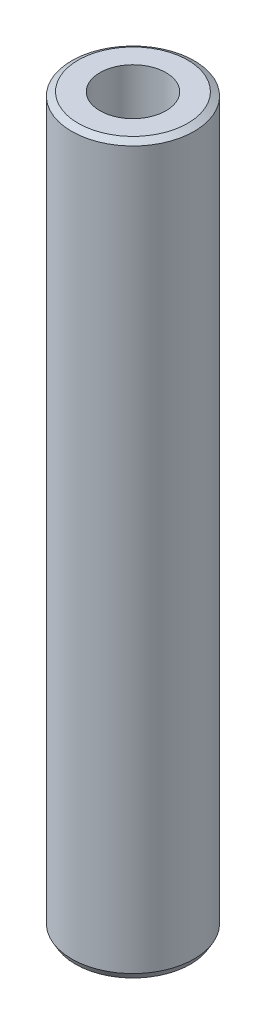
ISO-10303-21;
HEADER;
FILE_DESCRIPTION(('STEP AP214'),'2;1');
FILE_NAME('part.step','',(''),(''),'','','');
FILE_SCHEMA(('AUTOMOTIVE_DESIGN { 1 0 10303 214 1 1 1 1 }'));
ENDSEC;
DATA;
#1=APPLICATION_CONTEXT('core data for automotive mechanical design processes');
#2=APPLICATION_PROTOCOL_DEFINITION('international standard','automotive_design',2000,#1);
#3=PRODUCT_CONTEXT('',#1,'mechanical');
#4=PRODUCT('Part','Part','',(#3));
#5=PRODUCT_RELATED_PRODUCT_CATEGORY('part','',(#4));
#6=PRODUCT_DEFINITION_FORMATION('','',#4);
#7=PRODUCT_DEFINITION_CONTEXT('part definition',#1,'design');
#8=PRODUCT_DEFINITION('design','',#6,#7);
#9=PRODUCT_DEFINITION_SHAPE('','',#8);
#10=(LENGTH_UNIT() NAMED_UNIT(*) SI_UNIT(.MILLI.,.METRE.));
#11=(NAMED_UNIT(*) PLANE_ANGLE_UNIT() SI_UNIT($,.RADIAN.));
#12=(NAMED_UNIT(*) SI_UNIT($,.STERADIAN.) SOLID_ANGLE_UNIT());
#13=UNCERTAINTY_MEASURE_WITH_UNIT(LENGTH_MEASURE(1.E-05),#10,'distance_accuracy_value','');
#14=(GEOMETRIC_REPRESENTATION_CONTEXT(3) GLOBAL_UNCERTAINTY_ASSIGNED_CONTEXT((#13)) GLOBAL_UNIT_ASSIGNED_CONTEXT((#10,
#11,#12)) REPRESENTATION_CONTEXT('',''));
#15=CARTESIAN_POINT('',(0.,0.,0.));
#16=DIRECTION('',(0.,0.,1.));
#17=DIRECTION('',(1.,0.,0.));
#18=AXIS2_PLACEMENT_3D('',#15,#16,#17);
#19=CARTESIAN_POINT('',(0.,59.3318698835942,0.));
#20=DIRECTION('',(0.,-1.,0.));
#21=DIRECTION('',(0.,0.,-1.));
#22=AXIS2_PLACEMENT_3D('',#19,#20,#21);
#23=CYLINDRICAL_SURFACE('',#22,5.);
#24=CARTESIAN_POINT('',(0.,59.0266979990249,0.));
#25=DIRECTION('',(0.,1.,0.));
#26=DIRECTION('',(0.,0.,1.));
#27=AXIS2_PLACEMENT_3D('',#24,#25,#26);
#28=CIRCLE('',#27,5.);
#29=CARTESIAN_POINT('',(0.,59.0266979990249,5.));
#30=VERTEX_POINT('',#29);
#31=EDGE_CURVE('E50',#30,#30,#28,.F.);
#32=ORIENTED_EDGE('',*,*,#31,.T.);
#33=EDGE_LOOP('',(#32));
#34=FACE_BOUND('',#33,.T.);
#35=CARTESIAN_POINT('',(0.,0.528573209115569,0.));
#36=DIRECTION('',(0.,1.,0.));
#37=DIRECTION('',(0.,0.,1.));
#38=AXIS2_PLACEMENT_3D('',#35,#36,#37);
#39=CIRCLE('',#38,5.);
#40=CARTESIAN_POINT('',(0.,0.528573209115569,5.));
#41=VERTEX_POINT('',#40);
#42=EDGE_CURVE('E51',#41,#41,#39,.T.);
#43=ORIENTED_EDGE('',*,*,#42,.T.);
#44=EDGE_LOOP('',(#43));
#45=FACE_BOUND('',#44,.T.);
#46=ADVANCED_FACE('F39',(#34,#45),#23,.T.);
#47=CARTESIAN_POINT('',(0.,59.3318698835942,0.));
#48=DIRECTION('',(0.,1.,0.));
#49=DIRECTION('',(0.,0.,1.));
#50=AXIS2_PLACEMENT_3D('',#47,#48,#49);
#51=PLANE('',#50);
#52=CARTESIAN_POINT('',(0.,59.3318698835942,0.));
#53=DIRECTION('',(0.,1.,0.));
#54=DIRECTION('',(0.,0.,1.));
#55=AXIS2_PLACEMENT_3D('',#52,#53,#54);
#56=CIRCLE('',#55,4.47142679088443);
#57=CARTESIAN_POINT('',(0.,59.3318698835942,4.47142679088443));
#58=VERTEX_POINT('',#57);
#59=EDGE_CURVE('E54',#58,#58,#56,.T.);
#60=ORIENTED_EDGE('',*,*,#59,.T.);
#61=EDGE_LOOP('',(#60));
#62=FACE_BOUND('',#61,.T.);
#63=CARTESIAN_POINT('',(0.,59.3318698835942,0.));
#64=DIRECTION('',(0.,1.,0.));
#65=DIRECTION('',(0.,0.,1.));
#66=AXIS2_PLACEMENT_3D('',#63,#64,#65);
#67=CIRCLE('',#66,2.69770198623453);
#68=CARTESIAN_POINT('',(0.,59.3318698835942,2.69770198623453));
#69=VERTEX_POINT('',#68);
#70=EDGE_CURVE('E58',#69,#69,#67,.T.);
#71=ORIENTED_EDGE('',*,*,#70,.F.);
#72=EDGE_LOOP('',(#71));
#73=FACE_BOUND('',#72,.T.);
#74=ADVANCED_FACE('F69',(#62,#73),#51,.T.);
#75=CARTESIAN_POINT('',(0.,0.,0.));
#76=DIRECTION('',(0.,1.,0.));
#77=DIRECTION('',(0.,0.,1.));
#78=AXIS2_PLACEMENT_3D('',#75,#76,#77);
#79=PLANE('',#78);
#80=CARTESIAN_POINT('',(0.,0.,0.));
#81=DIRECTION('',(0.,1.,0.));
#82=DIRECTION('',(0.,0.,1.));
#83=AXIS2_PLACEMENT_3D('',#80,#81,#82);
#84=CIRCLE('',#83,4.6948281154307);
#85=CARTESIAN_POINT('',(0.,0.,4.6948281154307));
#86=VERTEX_POINT('',#85);
#87=EDGE_CURVE('E10',#86,#86,#84,.F.);
#88=ORIENTED_EDGE('',*,*,#87,.T.);
#89=EDGE_LOOP('',(#88));
#90=FACE_BOUND('',#89,.T.);
#91=CARTESIAN_POINT('',(0.,0.,0.));
#92=DIRECTION('',(0.,1.,0.));
#93=DIRECTION('',(0.,0.,1.));
#94=AXIS2_PLACEMENT_3D('',#91,#92,#93);
#95=CIRCLE('',#94,2.69770198623453);
#96=CARTESIAN_POINT('',(0.,0.,2.69770198623453));
#97=VERTEX_POINT('',#96);
#98=EDGE_CURVE('E63',#97,#97,#95,.T.);
#99=ORIENTED_EDGE('',*,*,#98,.T.);
#100=EDGE_LOOP('',(#99));
#101=FACE_BOUND('',#100,.T.);
#102=ADVANCED_FACE('F75',(#90,#101),#79,.F.);
#103=CARTESIAN_POINT('',(0.,59.3318698835942,0.));
#104=DIRECTION('',(0.,-1.,0.));
#105=DIRECTION('',(0.,0.,-1.));
#106=AXIS2_PLACEMENT_3D('',#103,#104,#105);
#107=CYLINDRICAL_SURFACE('',#106,2.69770198623453);
#108=ORIENTED_EDGE('',*,*,#70,.T.);
#109=EDGE_LOOP('',(#108));
#110=FACE_BOUND('',#109,.T.);
#111=ORIENTED_EDGE('',*,*,#98,.F.);
#112=EDGE_LOOP('',(#111));
#113=FACE_BOUND('',#112,.T.);
#114=ADVANCED_FACE('F70',(#110,#113),#107,.F.);
#115=CARTESIAN_POINT('',(0.,59.3318698835942,0.));
#116=DIRECTION('',(0.,-1.,0.));
#117=DIRECTION('',(0.,0.,-1.));
#118=AXIS2_PLACEMENT_3D('',#115,#116,#117);
#119=CONICAL_SURFACE('',#118,4.47142679088443,1.0471975511966);
#120=ORIENTED_EDGE('',*,*,#31,.F.);
#121=EDGE_LOOP('',(#120));
#122=FACE_BOUND('',#121,.T.);
#123=ORIENTED_EDGE('',*,*,#59,.F.);
#124=EDGE_LOOP('',(#123));
#125=FACE_BOUND('',#124,.T.);
#126=ADVANCED_FACE('F81',(#122,#125),#119,.T.);
#127=CARTESIAN_POINT('',(0.,0.528573209115569,0.));
#128=DIRECTION('',(0.,1.,0.));
#129=DIRECTION('',(0.,0.,1.));
#130=AXIS2_PLACEMENT_3D('',#127,#128,#129);
#131=CONICAL_SURFACE('',#130,5.,0.523598775598294);
#132=ORIENTED_EDGE('',*,*,#87,.F.);
#133=EDGE_LOOP('',(#132));
#134=FACE_BOUND('',#133,.T.);
#135=ORIENTED_EDGE('',*,*,#42,.F.);
#136=EDGE_LOOP('',(#135));
#137=FACE_BOUND('',#136,.T.);
#138=ADVANCED_FACE('F45',(#134,#137),#131,.T.);
#139=CLOSED_SHELL('',(#46,#74,#102,#114,#126,#138));
#140=MANIFOLD_SOLID_BREP('B2',#139);
#141=ADVANCED_BREP_SHAPE_REPRESENTATION('',(#18,#140),#14);
#142=SHAPE_DEFINITION_REPRESENTATION(#9,#141);
ENDSEC;
END-ISO-10303-21;
